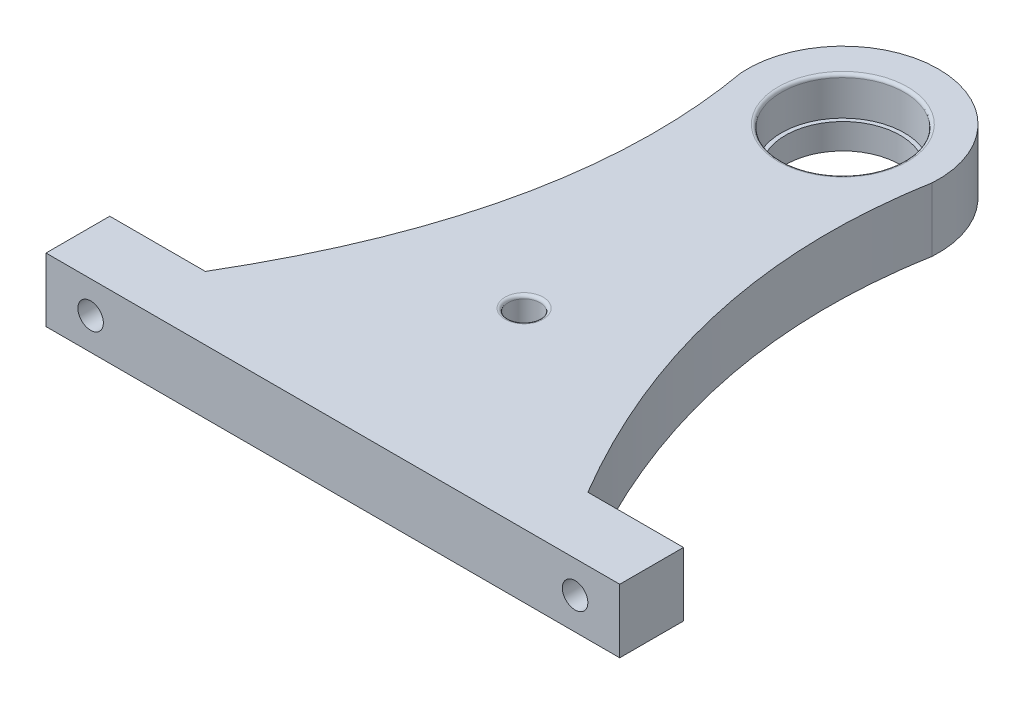
ISO-10303-21;
HEADER;
FILE_DESCRIPTION(('STEP AP214'),'2;1');
FILE_NAME('part.step','',(''),(''),'','','');
FILE_SCHEMA(('AUTOMOTIVE_DESIGN { 1 0 10303 214 1 1 1 1 }'));
ENDSEC;
DATA;
#1=APPLICATION_CONTEXT('core data for automotive mechanical design processes');
#2=APPLICATION_PROTOCOL_DEFINITION('international standard','automotive_design',2000,#1);
#3=PRODUCT_CONTEXT('',#1,'mechanical');
#4=PRODUCT('Part','Part','',(#3));
#5=PRODUCT_RELATED_PRODUCT_CATEGORY('part','',(#4));
#6=PRODUCT_DEFINITION_FORMATION('','',#4);
#7=PRODUCT_DEFINITION_CONTEXT('part definition',#1,'design');
#8=PRODUCT_DEFINITION('design','',#6,#7);
#9=PRODUCT_DEFINITION_SHAPE('','',#8);
#10=(LENGTH_UNIT() NAMED_UNIT(*) SI_UNIT(.MILLI.,.METRE.));
#11=(NAMED_UNIT(*) PLANE_ANGLE_UNIT() SI_UNIT($,.RADIAN.));
#12=(NAMED_UNIT(*) SI_UNIT($,.STERADIAN.) SOLID_ANGLE_UNIT());
#13=UNCERTAINTY_MEASURE_WITH_UNIT(LENGTH_MEASURE(1.E-05),#10,'distance_accuracy_value','');
#14=(GEOMETRIC_REPRESENTATION_CONTEXT(3) GLOBAL_UNCERTAINTY_ASSIGNED_CONTEXT((#13)) GLOBAL_UNIT_ASSIGNED_CONTEXT((#10,
#11,#12)) REPRESENTATION_CONTEXT('',''));
#15=CARTESIAN_POINT('',(0.,0.,0.));
#16=DIRECTION('',(0.,0.,1.));
#17=DIRECTION('',(1.,0.,0.));
#18=AXIS2_PLACEMENT_3D('',#15,#16,#17);
#19=CARTESIAN_POINT('',(0.,9.5,-42.9636095718237));
#20=DIRECTION('',(0.,1.,0.));
#21=DIRECTION('',(0.,0.,1.));
#22=AXIS2_PLACEMENT_3D('',#19,#20,#21);
#23=TOROIDAL_SURFACE('',#22,10.15,0.5);
#24=CARTESIAN_POINT('',(0.,9.5,-42.9636095718237));
#25=DIRECTION('',(0.,1.,0.));
#26=DIRECTION('',(0.,0.,1.));
#27=AXIS2_PLACEMENT_3D('',#24,#25,#26);
#28=CIRCLE('',#27,9.65);
#29=CARTESIAN_POINT('',(0.,9.5,-33.3136095718237));
#30=VERTEX_POINT('',#29);
#31=EDGE_CURVE('E44',#30,#30,#28,.T.);
#32=ORIENTED_EDGE('',*,*,#31,.F.);
#33=EDGE_LOOP('',(#32));
#34=FACE_BOUND('',#33,.T.);
#35=CARTESIAN_POINT('',(0.,10.,-42.9636095718237));
#36=DIRECTION('',(0.,1.,0.));
#37=DIRECTION('',(0.,0.,1.));
#38=AXIS2_PLACEMENT_3D('',#35,#36,#37);
#39=CIRCLE('',#38,10.15);
#40=CARTESIAN_POINT('',(0.,10.,-32.8136095718237));
#41=VERTEX_POINT('',#40);
#42=EDGE_CURVE('E11',#41,#41,#39,.F.);
#43=ORIENTED_EDGE('',*,*,#42,.F.);
#44=EDGE_LOOP('',(#43));
#45=FACE_BOUND('',#44,.T.);
#46=ADVANCED_FACE('F36',(#34,#45),#23,.T.);
#47=CARTESIAN_POINT('',(0.,9.5,7.03639042817632));
#48=DIRECTION('',(0.,1.,0.));
#49=DIRECTION('',(0.,0.,1.));
#50=AXIS2_PLACEMENT_3D('',#47,#48,#49);
#51=TOROIDAL_SURFACE('',#50,3.,0.5);
#52=CARTESIAN_POINT('',(0.,9.5,7.03639042817632));
#53=DIRECTION('',(0.,1.,0.));
#54=DIRECTION('',(0.,0.,1.));
#55=AXIS2_PLACEMENT_3D('',#52,#53,#54);
#56=CIRCLE('',#55,2.5);
#57=CARTESIAN_POINT('',(0.,9.5,9.53639042817632));
#58=VERTEX_POINT('',#57);
#59=EDGE_CURVE('E173',#58,#58,#56,.T.);
#60=ORIENTED_EDGE('',*,*,#59,.F.);
#61=EDGE_LOOP('',(#60));
#62=FACE_BOUND('',#61,.T.);
#63=CARTESIAN_POINT('',(0.,10.,7.03639042817632));
#64=DIRECTION('',(0.,1.,0.));
#65=DIRECTION('',(0.,0.,1.));
#66=AXIS2_PLACEMENT_3D('',#63,#64,#65);
#67=CIRCLE('',#66,3.);
#68=CARTESIAN_POINT('',(0.,10.,10.0363904281763));
#69=VERTEX_POINT('',#68);
#70=EDGE_CURVE('E176',#69,#69,#67,.F.);
#71=ORIENTED_EDGE('',*,*,#70,.F.);
#72=EDGE_LOOP('',(#71));
#73=FACE_BOUND('',#72,.T.);
#74=ADVANCED_FACE('F186',(#62,#73),#51,.T.);
#75=CARTESIAN_POINT('',(45.,10.,27.0363904281763));
#76=DIRECTION('',(0.,0.,1.));
#77=DIRECTION('',(1.,0.,0.));
#78=AXIS2_PLACEMENT_3D('',#75,#76,#77);
#79=PLANE('',#78);
#80=CARTESIAN_POINT('',(38.,5.,27.0363904281764));
#81=DIRECTION('',(0.,0.,-1.));
#82=DIRECTION('',(-1.,0.,0.));
#83=AXIS2_PLACEMENT_3D('',#80,#81,#82);
#84=CIRCLE('',#83,2.);
#85=CARTESIAN_POINT('',(36.,5.,27.0363904281764));
#86=VERTEX_POINT('',#85);
#87=EDGE_CURVE('E279',#86,#86,#84,.T.);
#88=ORIENTED_EDGE('',*,*,#87,.F.);
#89=EDGE_LOOP('',(#88));
#90=FACE_BOUND('',#89,.T.);
#91=DIRECTION('',(-1.,0.,0.));
#92=VECTOR('',#91,1.);
#93=CARTESIAN_POINT('',(45.,0.,27.0363904281763));
#94=LINE('',#93,#92);
#95=CARTESIAN_POINT('',(45.,0.,27.0363904281763));
#96=VERTEX_POINT('',#95);
#97=CARTESIAN_POINT('',(30.,0.,27.0363904281763));
#98=VERTEX_POINT('',#97);
#99=EDGE_CURVE('E133',#96,#98,#94,.T.);
#100=ORIENTED_EDGE('',*,*,#99,.T.);
#101=DIRECTION('',(0.,-1.,0.));
#102=VECTOR('',#101,1.);
#103=CARTESIAN_POINT('',(30.,10.,27.0363904281763));
#104=LINE('',#103,#102);
#105=CARTESIAN_POINT('',(30.,10.,27.0363904281763));
#106=VERTEX_POINT('',#105);
#107=EDGE_CURVE('E171',#106,#98,#104,.T.);
#108=ORIENTED_EDGE('',*,*,#107,.F.);
#109=DIRECTION('',(-1.,0.,0.));
#110=VECTOR('',#109,1.);
#111=CARTESIAN_POINT('',(45.,10.,27.0363904281763));
#112=LINE('',#111,#110);
#113=CARTESIAN_POINT('',(45.,10.,27.0363904281763));
#114=VERTEX_POINT('',#113);
#115=EDGE_CURVE('E158',#114,#106,#112,.T.);
#116=ORIENTED_EDGE('',*,*,#115,.F.);
#117=DIRECTION('',(0.,-1.,0.));
#118=VECTOR('',#117,1.);
#119=CARTESIAN_POINT('',(45.,10.,27.0363904281763));
#120=LINE('',#119,#118);
#121=EDGE_CURVE('E129',#114,#96,#120,.T.);
#122=ORIENTED_EDGE('',*,*,#121,.T.);
#123=EDGE_LOOP('',(#100,#108,#116,#122));
#124=FACE_BOUND('',#123,.T.);
#125=ADVANCED_FACE('F197',(#90,#124),#79,.F.);
#126=CARTESIAN_POINT('',(30.,10.,27.0363904281763));
#127=CARTESIAN_POINT('',(8.98218983068453,10.,-8.48267973376618));
#128=CARTESIAN_POINT('',(14.9684163499675,10.,-41.9907211023547));
#129=B_SPLINE_CURVE_WITH_KNOTS('',2,(#126,#127,#128),.UNSPECIFIED.,.F.,.F.,(3,3),(0.,
0.673052387560121),.UNSPECIFIED.);
#130=DIRECTION('',(0.,-1.,0.));
#131=VECTOR('',#130,1.);
#132=SURFACE_OF_LINEAR_EXTRUSION('',#129,#131);
#133=CARTESIAN_POINT('',(30.,0.,27.0363904281763));
#134=CARTESIAN_POINT('',(8.98218983068453,0.,-8.48267973376618));
#135=CARTESIAN_POINT('',(14.9684163499675,0.,-41.9907211023547));
#136=B_SPLINE_CURVE_WITH_KNOTS('',2,(#133,#134,#135),.UNSPECIFIED.,.F.,.F.,(3,3),(0.,
0.673052387560121),.UNSPECIFIED.);
#137=CARTESIAN_POINT('',(14.9684163499675,0.,-41.9907211023547));
#138=VERTEX_POINT('',#137);
#139=EDGE_CURVE('E136',#98,#138,#136,.T.);
#140=ORIENTED_EDGE('',*,*,#139,.T.);
#141=DIRECTION('',(0.,-1.,0.));
#142=VECTOR('',#141,1.);
#143=CARTESIAN_POINT('',(14.9684163499675,10.,-41.9907211023547));
#144=LINE('',#143,#142);
#145=CARTESIAN_POINT('',(14.9684163499675,10.,-41.9907211023547));
#146=VERTEX_POINT('',#145);
#147=EDGE_CURVE('E168',#146,#138,#144,.T.);
#148=ORIENTED_EDGE('',*,*,#147,.F.);
#149=EDGE_CURVE('E96',#106,#146,#129,.T.);
#150=ORIENTED_EDGE('',*,*,#149,.F.);
#151=ORIENTED_EDGE('',*,*,#107,.T.);
#152=EDGE_LOOP('',(#140,#148,#150,#151));
#153=FACE_BOUND('',#152,.T.);
#154=ADVANCED_FACE('F202',(#153),#132,.F.);
#155=CARTESIAN_POINT('',(0.,10.,-42.9636095718237));
#156=DIRECTION('',(0.,-1.,0.));
#157=DIRECTION('',(0.,0.,-1.));
#158=AXIS2_PLACEMENT_3D('',#155,#156,#157);
#159=CYLINDRICAL_SURFACE('',#158,15.);
#160=CARTESIAN_POINT('',(0.,0.,-42.9636095718237));
#161=DIRECTION('',(0.,1.,0.));
#162=DIRECTION('',(0.,0.,1.));
#163=AXIS2_PLACEMENT_3D('',#160,#161,#162);
#164=CIRCLE('',#163,15.);
#165=CARTESIAN_POINT('',(-14.9684163499675,0.,-41.9907211023547));
#166=VERTEX_POINT('',#165);
#167=EDGE_CURVE('E141',#138,#166,#164,.T.);
#168=ORIENTED_EDGE('',*,*,#167,.T.);
#169=DIRECTION('',(0.,-1.,0.));
#170=VECTOR('',#169,1.);
#171=CARTESIAN_POINT('',(-14.9684163499675,10.,-41.9907211023547));
#172=LINE('',#171,#170);
#173=CARTESIAN_POINT('',(-14.9684163499675,10.,-41.9907211023547));
#174=VERTEX_POINT('',#173);
#175=EDGE_CURVE('E165',#174,#166,#172,.T.);
#176=ORIENTED_EDGE('',*,*,#175,.F.);
#177=CARTESIAN_POINT('',(0.,10.,-42.9636095718237));
#178=DIRECTION('',(0.,1.,0.));
#179=DIRECTION('',(0.,0.,1.));
#180=AXIS2_PLACEMENT_3D('',#177,#178,#179);
#181=CIRCLE('',#180,15.);
#182=EDGE_CURVE('E217',#146,#174,#181,.T.);
#183=ORIENTED_EDGE('',*,*,#182,.F.);
#184=ORIENTED_EDGE('',*,*,#147,.T.);
#185=EDGE_LOOP('',(#168,#176,#183,#184));
#186=FACE_BOUND('',#185,.T.);
#187=ADVANCED_FACE('F210',(#186),#159,.T.);
#188=CARTESIAN_POINT('',(-14.9684163499675,10.,-41.9907211023547));
#189=CARTESIAN_POINT('',(-8.98218983068453,10.,-8.48267973376618));
#190=CARTESIAN_POINT('',(-30.,10.,27.0363904281763));
#191=B_SPLINE_CURVE_WITH_KNOTS('',2,(#188,#189,#190),.UNSPECIFIED.,.F.,.F.,(3,3),(0.,
0.673052387560121),.UNSPECIFIED.);
#192=DIRECTION('',(0.,-1.,0.));
#193=VECTOR('',#192,1.);
#194=SURFACE_OF_LINEAR_EXTRUSION('',#191,#193);
#195=CARTESIAN_POINT('',(-14.9684163499675,0.,-41.9907211023547));
#196=CARTESIAN_POINT('',(-8.98218983068453,0.,-8.48267973376618));
#197=CARTESIAN_POINT('',(-30.,0.,27.0363904281763));
#198=B_SPLINE_CURVE_WITH_KNOTS('',2,(#195,#196,#197),.UNSPECIFIED.,.F.,.F.,(3,3),(0.,
0.673052387560121),.UNSPECIFIED.);
#199=CARTESIAN_POINT('',(-30.,0.,27.0363904281763));
#200=VERTEX_POINT('',#199);
#201=EDGE_CURVE('E146',#166,#200,#198,.T.);
#202=ORIENTED_EDGE('',*,*,#201,.T.);
#203=DIRECTION('',(0.,-1.,0.));
#204=VECTOR('',#203,1.);
#205=CARTESIAN_POINT('',(-30.,10.,27.0363904281763));
#206=LINE('',#205,#204);
#207=CARTESIAN_POINT('',(-30.,10.,27.0363904281763));
#208=VERTEX_POINT('',#207);
#209=EDGE_CURVE('E162',#208,#200,#206,.T.);
#210=ORIENTED_EDGE('',*,*,#209,.F.);
#211=EDGE_CURVE('E223',#174,#208,#191,.T.);
#212=ORIENTED_EDGE('',*,*,#211,.F.);
#213=ORIENTED_EDGE('',*,*,#175,.T.);
#214=EDGE_LOOP('',(#202,#210,#212,#213));
#215=FACE_BOUND('',#214,.T.);
#216=ADVANCED_FACE('F230',(#215),#194,.F.);
#217=CARTESIAN_POINT('',(-45.,10.,27.0363904281763));
#218=DIRECTION('',(0.,0.,1.));
#219=DIRECTION('',(1.,0.,0.));
#220=AXIS2_PLACEMENT_3D('',#217,#218,#219);
#221=PLANE('',#220);
#222=CARTESIAN_POINT('',(-38.,5.,27.0363904281763));
#223=DIRECTION('',(0.,0.,-1.));
#224=DIRECTION('',(-1.,0.,0.));
#225=AXIS2_PLACEMENT_3D('',#222,#223,#224);
#226=CIRCLE('',#225,2.);
#227=CARTESIAN_POINT('',(-40.,5.,27.0363904281763));
#228=VERTEX_POINT('',#227);
#229=EDGE_CURVE('E286',#228,#228,#226,.T.);
#230=ORIENTED_EDGE('',*,*,#229,.F.);
#231=EDGE_LOOP('',(#230));
#232=FACE_BOUND('',#231,.T.);
#233=DIRECTION('',(-1.,0.,0.));
#234=VECTOR('',#233,1.);
#235=CARTESIAN_POINT('',(-45.,0.,27.0363904281763));
#236=LINE('',#235,#234);
#237=CARTESIAN_POINT('',(-45.,0.,27.0363904281763));
#238=VERTEX_POINT('',#237);
#239=EDGE_CURVE('E150',#200,#238,#236,.T.);
#240=ORIENTED_EDGE('',*,*,#239,.T.);
#241=DIRECTION('',(0.,-1.,0.));
#242=VECTOR('',#241,1.);
#243=CARTESIAN_POINT('',(-45.,10.,27.0363904281763));
#244=LINE('',#243,#242);
#245=CARTESIAN_POINT('',(-45.,10.,27.0363904281763));
#246=VERTEX_POINT('',#245);
#247=EDGE_CURVE('E124',#246,#238,#244,.T.);
#248=ORIENTED_EDGE('',*,*,#247,.F.);
#249=DIRECTION('',(-1.,0.,0.));
#250=VECTOR('',#249,1.);
#251=CARTESIAN_POINT('',(-45.,10.,27.0363904281763));
#252=LINE('',#251,#250);
#253=EDGE_CURVE('E115',#208,#246,#252,.T.);
#254=ORIENTED_EDGE('',*,*,#253,.F.);
#255=ORIENTED_EDGE('',*,*,#209,.T.);
#256=EDGE_LOOP('',(#240,#248,#254,#255));
#257=FACE_BOUND('',#256,.T.);
#258=ADVANCED_FACE('F233',(#232,#257),#221,.F.);
#259=CARTESIAN_POINT('',(-45.,10.,37.0363904281763));
#260=DIRECTION('',(1.,0.,0.));
#261=DIRECTION('',(0.,0.,-1.));
#262=AXIS2_PLACEMENT_3D('',#259,#260,#261);
#263=PLANE('',#262);
#264=DIRECTION('',(0.,0.,1.));
#265=VECTOR('',#264,1.);
#266=CARTESIAN_POINT('',(-45.,0.,37.0363904281763));
#267=LINE('',#266,#265);
#268=CARTESIAN_POINT('',(-45.,0.,37.0363904281763));
#269=VERTEX_POINT('',#268);
#270=EDGE_CURVE('E123',#238,#269,#267,.T.);
#271=ORIENTED_EDGE('',*,*,#270,.T.);
#272=DIRECTION('',(0.,-1.,0.));
#273=VECTOR('',#272,1.);
#274=CARTESIAN_POINT('',(-45.,10.,37.0363904281763));
#275=LINE('',#274,#273);
#276=CARTESIAN_POINT('',(-45.,10.,37.0363904281763));
#277=VERTEX_POINT('',#276);
#278=EDGE_CURVE('E120',#277,#269,#275,.T.);
#279=ORIENTED_EDGE('',*,*,#278,.F.);
#280=DIRECTION('',(0.,0.,1.));
#281=VECTOR('',#280,1.);
#282=CARTESIAN_POINT('',(-45.,10.,37.0363904281763));
#283=LINE('',#282,#281);
#284=EDGE_CURVE('E109',#246,#277,#283,.T.);
#285=ORIENTED_EDGE('',*,*,#284,.F.);
#286=ORIENTED_EDGE('',*,*,#247,.T.);
#287=EDGE_LOOP('',(#271,#279,#285,#286));
#288=FACE_BOUND('',#287,.T.);
#289=ADVANCED_FACE('F121',(#288),#263,.F.);
#290=CARTESIAN_POINT('',(-45.,10.,37.0363904281763));
#291=DIRECTION('',(0.,0.,-1.));
#292=DIRECTION('',(-1.,0.,0.));
#293=AXIS2_PLACEMENT_3D('',#290,#291,#292);
#294=PLANE('',#293);
#295=CARTESIAN_POINT('',(38.,5.,37.0363904281764));
#296=DIRECTION('',(0.,0.,-1.));
#297=DIRECTION('',(-1.,0.,0.));
#298=AXIS2_PLACEMENT_3D('',#295,#296,#297);
#299=CIRCLE('',#298,2.);
#300=CARTESIAN_POINT('',(36.,5.,37.0363904281764));
#301=VERTEX_POINT('',#300);
#302=EDGE_CURVE('E282',#301,#301,#299,.T.);
#303=ORIENTED_EDGE('',*,*,#302,.T.);
#304=EDGE_LOOP('',(#303));
#305=FACE_BOUND('',#304,.T.);
#306=CARTESIAN_POINT('',(-38.,5.,37.0363904281763));
#307=DIRECTION('',(0.,0.,-1.));
#308=DIRECTION('',(-1.,0.,0.));
#309=AXIS2_PLACEMENT_3D('',#306,#307,#308);
#310=CIRCLE('',#309,2.);
#311=CARTESIAN_POINT('',(-40.,5.,37.0363904281763));
#312=VERTEX_POINT('',#311);
#313=EDGE_CURVE('E288',#312,#312,#310,.T.);
#314=ORIENTED_EDGE('',*,*,#313,.T.);
#315=EDGE_LOOP('',(#314));
#316=FACE_BOUND('',#315,.T.);
#317=DIRECTION('',(1.,0.,0.));
#318=VECTOR('',#317,1.);
#319=CARTESIAN_POINT('',(-45.,0.,37.0363904281763));
#320=LINE('',#319,#318);
#321=CARTESIAN_POINT('',(45.,0.,37.0363904281763));
#322=VERTEX_POINT('',#321);
#323=EDGE_CURVE('E81',#269,#322,#320,.T.);
#324=ORIENTED_EDGE('',*,*,#323,.T.);
#325=DIRECTION('',(0.,-1.,0.));
#326=VECTOR('',#325,1.);
#327=CARTESIAN_POINT('',(45.,10.,37.0363904281763));
#328=LINE('',#327,#326);
#329=CARTESIAN_POINT('',(45.,10.,37.0363904281763));
#330=VERTEX_POINT('',#329);
#331=EDGE_CURVE('E125',#330,#322,#328,.T.);
#332=ORIENTED_EDGE('',*,*,#331,.F.);
#333=DIRECTION('',(1.,0.,0.));
#334=VECTOR('',#333,1.);
#335=CARTESIAN_POINT('',(-45.,10.,37.0363904281763));
#336=LINE('',#335,#334);
#337=EDGE_CURVE('E113',#277,#330,#336,.T.);
#338=ORIENTED_EDGE('',*,*,#337,.F.);
#339=ORIENTED_EDGE('',*,*,#278,.T.);
#340=EDGE_LOOP('',(#324,#332,#338,#339));
#341=FACE_BOUND('',#340,.T.);
#342=ADVANCED_FACE('F127',(#305,#316,#341),#294,.F.);
#343=CARTESIAN_POINT('',(45.,10.,37.0363904281763));
#344=DIRECTION('',(-1.,0.,0.));
#345=DIRECTION('',(0.,0.,1.));
#346=AXIS2_PLACEMENT_3D('',#343,#344,#345);
#347=PLANE('',#346);
#348=DIRECTION('',(0.,0.,-1.));
#349=VECTOR('',#348,1.);
#350=CARTESIAN_POINT('',(45.,0.,37.0363904281763));
#351=LINE('',#350,#349);
#352=EDGE_CURVE('E87',#322,#96,#351,.T.);
#353=ORIENTED_EDGE('',*,*,#352,.T.);
#354=ORIENTED_EDGE('',*,*,#121,.F.);
#355=DIRECTION('',(0.,0.,-1.));
#356=VECTOR('',#355,1.);
#357=CARTESIAN_POINT('',(45.,10.,37.0363904281763));
#358=LINE('',#357,#356);
#359=EDGE_CURVE('E52',#330,#114,#358,.T.);
#360=ORIENTED_EDGE('',*,*,#359,.F.);
#361=ORIENTED_EDGE('',*,*,#331,.T.);
#362=EDGE_LOOP('',(#353,#354,#360,#361));
#363=FACE_BOUND('',#362,.T.);
#364=ADVANCED_FACE('F192',(#363),#347,.F.);
#365=CARTESIAN_POINT('',(15.7331990028341,10.,-7.97992253542768));
#366=DIRECTION('',(0.,1.,0.));
#367=DIRECTION('',(0.,0.,1.));
#368=AXIS2_PLACEMENT_3D('',#365,#366,#367);
#369=PLANE('',#368);
#370=ORIENTED_EDGE('',*,*,#42,.T.);
#371=EDGE_LOOP('',(#370));
#372=FACE_BOUND('',#371,.T.);
#373=ORIENTED_EDGE('',*,*,#70,.T.);
#374=EDGE_LOOP('',(#373));
#375=FACE_BOUND('',#374,.T.);
#376=ORIENTED_EDGE('',*,*,#115,.T.);
#377=ORIENTED_EDGE('',*,*,#149,.T.);
#378=ORIENTED_EDGE('',*,*,#182,.T.);
#379=ORIENTED_EDGE('',*,*,#211,.T.);
#380=ORIENTED_EDGE('',*,*,#253,.T.);
#381=ORIENTED_EDGE('',*,*,#284,.T.);
#382=ORIENTED_EDGE('',*,*,#337,.T.);
#383=ORIENTED_EDGE('',*,*,#359,.T.);
#384=EDGE_LOOP('',(#376,#377,#378,#379,#380,#381,#382,#383));
#385=FACE_BOUND('',#384,.T.);
#386=ADVANCED_FACE('F111',(#372,#375,#385),#369,.T.);
#387=CARTESIAN_POINT('',(15.7331990028341,0.,-7.97992253542768));
#388=DIRECTION('',(0.,1.,0.));
#389=DIRECTION('',(0.,0.,1.));
#390=AXIS2_PLACEMENT_3D('',#387,#388,#389);
#391=PLANE('',#390);
#392=CARTESIAN_POINT('',(0.,0.,-42.9636095718237));
#393=DIRECTION('',(0.,1.,0.));
#394=DIRECTION('',(0.,0.,1.));
#395=AXIS2_PLACEMENT_3D('',#392,#393,#394);
#396=CIRCLE('',#395,9.);
#397=CARTESIAN_POINT('',(0.,0.,-33.9636095718237));
#398=VERTEX_POINT('',#397);
#399=EDGE_CURVE('E294',#398,#398,#396,.T.);
#400=ORIENTED_EDGE('',*,*,#399,.T.);
#401=EDGE_LOOP('',(#400));
#402=FACE_BOUND('',#401,.T.);
#403=ORIENTED_EDGE('',*,*,#99,.F.);
#404=ORIENTED_EDGE('',*,*,#352,.F.);
#405=ORIENTED_EDGE('',*,*,#323,.F.);
#406=ORIENTED_EDGE('',*,*,#270,.F.);
#407=ORIENTED_EDGE('',*,*,#239,.F.);
#408=ORIENTED_EDGE('',*,*,#201,.F.);
#409=ORIENTED_EDGE('',*,*,#167,.F.);
#410=ORIENTED_EDGE('',*,*,#139,.F.);
#411=EDGE_LOOP('',(#403,#404,#405,#406,#407,#408,#409,#410));
#412=FACE_BOUND('',#411,.T.);
#413=ADVANCED_FACE('F191',(#402,#412),#391,.F.);
#414=CARTESIAN_POINT('',(0.,4.,-42.9636095718237));
#415=DIRECTION('',(0.,1.,0.));
#416=DIRECTION('',(0.,0.,1.));
#417=AXIS2_PLACEMENT_3D('',#414,#415,#416);
#418=CYLINDRICAL_SURFACE('',#417,9.65);
#419=ORIENTED_EDGE('',*,*,#31,.T.);
#420=EDGE_LOOP('',(#419));
#421=FACE_BOUND('',#420,.T.);
#422=CARTESIAN_POINT('',(0.,4.,-42.9636095718237));
#423=DIRECTION('',(0.,1.,0.));
#424=DIRECTION('',(0.,0.,1.));
#425=AXIS2_PLACEMENT_3D('',#422,#423,#424);
#426=CIRCLE('',#425,9.65);
#427=CARTESIAN_POINT('',(0.,4.,-33.3136095718237));
#428=VERTEX_POINT('',#427);
#429=EDGE_CURVE('E137',#428,#428,#426,.T.);
#430=ORIENTED_EDGE('',*,*,#429,.F.);
#431=EDGE_LOOP('',(#430));
#432=FACE_BOUND('',#431,.T.);
#433=ADVANCED_FACE('F181',(#421,#432),#418,.F.);
#434=CARTESIAN_POINT('',(0.,4.,-42.9636095718237));
#435=DIRECTION('',(0.,1.,0.));
#436=DIRECTION('',(0.,0.,1.));
#437=AXIS2_PLACEMENT_3D('',#434,#435,#436);
#438=PLANE('',#437);
#439=CARTESIAN_POINT('',(0.,4.,-42.9636095718237));
#440=DIRECTION('',(0.,1.,0.));
#441=DIRECTION('',(0.,0.,1.));
#442=AXIS2_PLACEMENT_3D('',#439,#440,#441);
#443=CIRCLE('',#442,9.);
#444=CARTESIAN_POINT('',(0.,4.,-33.9636095718237));
#445=VERTEX_POINT('',#444);
#446=EDGE_CURVE('E291',#445,#445,#443,.T.);
#447=ORIENTED_EDGE('',*,*,#446,.F.);
#448=EDGE_LOOP('',(#447));
#449=FACE_BOUND('',#448,.T.);
#450=ORIENTED_EDGE('',*,*,#429,.T.);
#451=EDGE_LOOP('',(#450));
#452=FACE_BOUND('',#451,.T.);
#453=ADVANCED_FACE('F250',(#449,#452),#438,.T.);
#454=CARTESIAN_POINT('',(0.,0.,-42.9636095718237));
#455=DIRECTION('',(0.,1.,0.));
#456=DIRECTION('',(0.,0.,1.));
#457=AXIS2_PLACEMENT_3D('',#454,#455,#456);
#458=CYLINDRICAL_SURFACE('',#457,9.);
#459=ORIENTED_EDGE('',*,*,#399,.F.);
#460=EDGE_LOOP('',(#459));
#461=FACE_BOUND('',#460,.T.);
#462=ORIENTED_EDGE('',*,*,#446,.T.);
#463=EDGE_LOOP('',(#462));
#464=FACE_BOUND('',#463,.T.);
#465=ADVANCED_FACE('F253',(#461,#464),#458,.F.);
#466=CARTESIAN_POINT('',(-38.,5.,37.0363904281763));
#467=DIRECTION('',(0.,0.,-1.));
#468=DIRECTION('',(-1.,0.,0.));
#469=AXIS2_PLACEMENT_3D('',#466,#467,#468);
#470=CYLINDRICAL_SURFACE('',#469,2.);
#471=ORIENTED_EDGE('',*,*,#313,.F.);
#472=EDGE_LOOP('',(#471));
#473=FACE_BOUND('',#472,.T.);
#474=ORIENTED_EDGE('',*,*,#229,.T.);
#475=EDGE_LOOP('',(#474));
#476=FACE_BOUND('',#475,.T.);
#477=ADVANCED_FACE('F257',(#473,#476),#470,.F.);
#478=CARTESIAN_POINT('',(38.,5.,37.0363904281764));
#479=DIRECTION('',(0.,0.,-1.));
#480=DIRECTION('',(-1.,0.,0.));
#481=AXIS2_PLACEMENT_3D('',#478,#479,#480);
#482=CYLINDRICAL_SURFACE('',#481,2.);
#483=ORIENTED_EDGE('',*,*,#302,.F.);
#484=EDGE_LOOP('',(#483));
#485=FACE_BOUND('',#484,.T.);
#486=ORIENTED_EDGE('',*,*,#87,.T.);
#487=EDGE_LOOP('',(#486));
#488=FACE_BOUND('',#487,.T.);
#489=ADVANCED_FACE('F261',(#485,#488),#482,.F.);
#490=CARTESIAN_POINT('',(0.,2.,7.03639042817632));
#491=DIRECTION('',(0.,1.,0.));
#492=DIRECTION('',(0.,0.,1.));
#493=AXIS2_PLACEMENT_3D('',#490,#491,#492);
#494=CYLINDRICAL_SURFACE('',#493,2.5);
#495=ORIENTED_EDGE('',*,*,#59,.T.);
#496=EDGE_LOOP('',(#495));
#497=FACE_BOUND('',#496,.T.);
#498=CARTESIAN_POINT('',(0.,2.,7.03639042817632));
#499=DIRECTION('',(0.,1.,0.));
#500=DIRECTION('',(0.,0.,1.));
#501=AXIS2_PLACEMENT_3D('',#498,#499,#500);
#502=CIRCLE('',#501,2.5);
#503=CARTESIAN_POINT('',(0.,2.,9.53639042817632));
#504=VERTEX_POINT('',#503);
#505=EDGE_CURVE('E277',#504,#504,#502,.T.);
#506=ORIENTED_EDGE('',*,*,#505,.F.);
#507=EDGE_LOOP('',(#506));
#508=FACE_BOUND('',#507,.T.);
#509=ADVANCED_FACE('F265',(#497,#508),#494,.F.);
#510=CARTESIAN_POINT('',(0.,2.,7.03639042817632));
#511=DIRECTION('',(0.,1.,0.));
#512=DIRECTION('',(0.,0.,1.));
#513=AXIS2_PLACEMENT_3D('',#510,#511,#512);
#514=PLANE('',#513);
#515=ORIENTED_EDGE('',*,*,#505,.T.);
#516=EDGE_LOOP('',(#515));
#517=FACE_BOUND('',#516,.T.);
#518=ADVANCED_FACE('F269',(#517),#514,.T.);
#519=CLOSED_SHELL('',(#46,#74,#125,#154,#187,#216,#258,#289,#342,#364,#386,#413,#433,#453,#465,
#477,#489,#509,#518));
#520=MANIFOLD_SOLID_BREP('B2',#519);
#521=ADVANCED_BREP_SHAPE_REPRESENTATION('',(#18,#520),#14);
#522=SHAPE_DEFINITION_REPRESENTATION(#9,#521);
ENDSEC;
END-ISO-10303-21;
